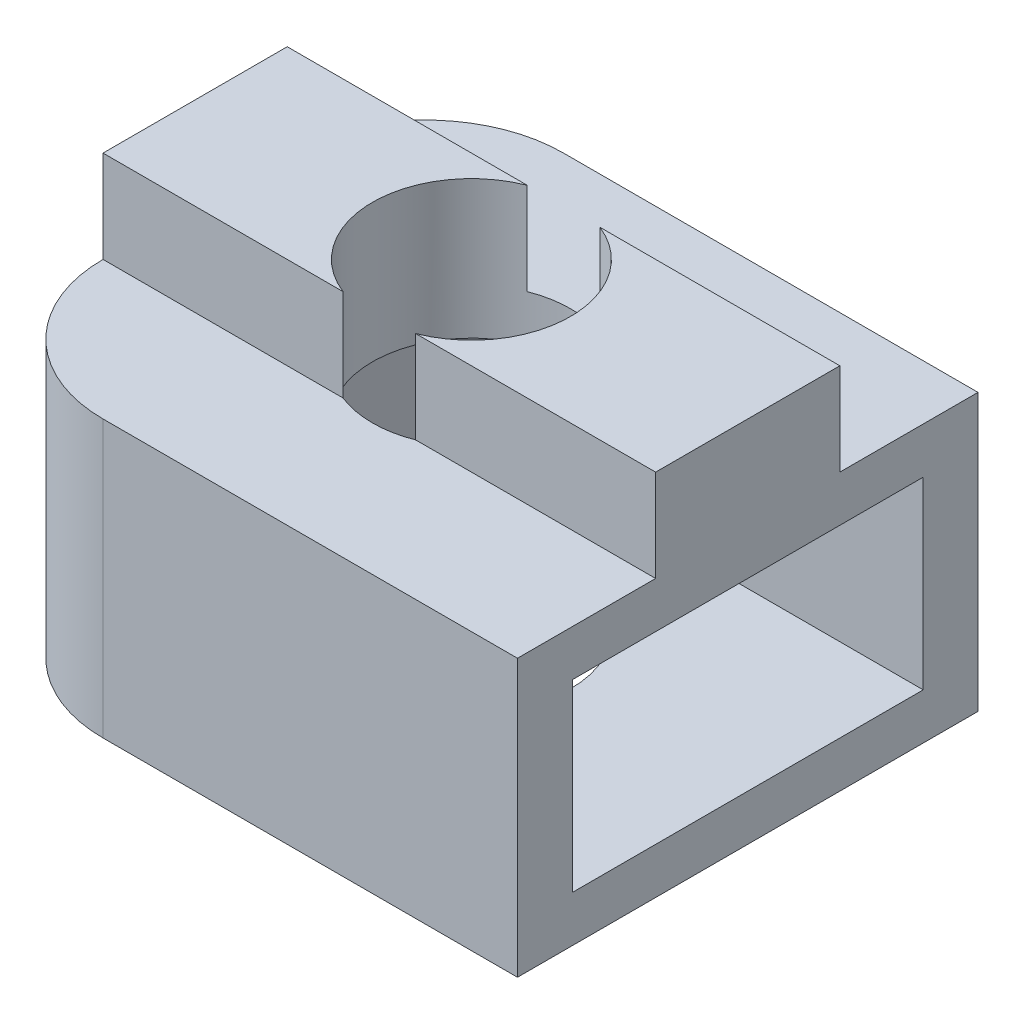
ISO-10303-21;
HEADER;
FILE_DESCRIPTION(('STEP AP214'),'2;1');
FILE_NAME('part.step','',(''),(''),'','','');
FILE_SCHEMA(('AUTOMOTIVE_DESIGN { 1 0 10303 214 1 1 1 1 }'));
ENDSEC;
DATA;
#1=APPLICATION_CONTEXT('core data for automotive mechanical design processes');
#2=APPLICATION_PROTOCOL_DEFINITION('international standard','automotive_design',2000,#1);
#3=PRODUCT_CONTEXT('',#1,'mechanical');
#4=PRODUCT('Part','Part','',(#3));
#5=PRODUCT_RELATED_PRODUCT_CATEGORY('part','',(#4));
#6=PRODUCT_DEFINITION_FORMATION('','',#4);
#7=PRODUCT_DEFINITION_CONTEXT('part definition',#1,'design');
#8=PRODUCT_DEFINITION('design','',#6,#7);
#9=PRODUCT_DEFINITION_SHAPE('','',#8);
#10=(LENGTH_UNIT() NAMED_UNIT(*) SI_UNIT(.MILLI.,.METRE.));
#11=(NAMED_UNIT(*) PLANE_ANGLE_UNIT() SI_UNIT($,.RADIAN.));
#12=(NAMED_UNIT(*) SI_UNIT($,.STERADIAN.) SOLID_ANGLE_UNIT());
#13=UNCERTAINTY_MEASURE_WITH_UNIT(LENGTH_MEASURE(1.E-05),#10,'distance_accuracy_value','');
#14=(GEOMETRIC_REPRESENTATION_CONTEXT(3) GLOBAL_UNCERTAINTY_ASSIGNED_CONTEXT((#13)) GLOBAL_UNIT_ASSIGNED_CONTEXT((#10,
#11,#12)) REPRESENTATION_CONTEXT('',''));
#15=CARTESIAN_POINT('',(0.,0.,0.));
#16=DIRECTION('',(0.,0.,1.));
#17=DIRECTION('',(1.,0.,0.));
#18=AXIS2_PLACEMENT_3D('',#15,#16,#17);
#19=CARTESIAN_POINT('',(-6.,8.,2.));
#20=DIRECTION('',(0.,0.,-1.));
#21=DIRECTION('',(-1.,0.,0.));
#22=AXIS2_PLACEMENT_3D('',#19,#20,#21);
#23=PLANE('',#22);
#24=DIRECTION('',(1.,0.,0.));
#25=VECTOR('',#24,1.);
#26=CARTESIAN_POINT('',(-6.,6.,2.));
#27=LINE('',#26,#25);
#28=CARTESIAN_POINT('',(-6.,6.,2.));
#29=VERTEX_POINT('',#28);
#30=CARTESIAN_POINT('',(-0.788986691902975,6.,2.));
#31=VERTEX_POINT('',#30);
#32=EDGE_CURVE('E205',#29,#31,#27,.T.);
#33=ORIENTED_EDGE('',*,*,#32,.T.);
#34=DIRECTION('',(0.,1.,0.));
#35=VECTOR('',#34,1.);
#36=CARTESIAN_POINT('',(-0.788986691902975,0.,2.));
#37=LINE('',#36,#35);
#38=CARTESIAN_POINT('',(-0.788986691902975,8.,2.));
#39=VERTEX_POINT('',#38);
#40=EDGE_CURVE('E343',#31,#39,#37,.T.);
#41=ORIENTED_EDGE('',*,*,#40,.T.);
#42=DIRECTION('',(1.,0.,0.));
#43=VECTOR('',#42,1.);
#44=CARTESIAN_POINT('',(-6.,8.,2.));
#45=LINE('',#44,#43);
#46=CARTESIAN_POINT('',(-6.,8.,2.));
#47=VERTEX_POINT('',#46);
#48=EDGE_CURVE('E190',#47,#39,#45,.T.);
#49=ORIENTED_EDGE('',*,*,#48,.F.);
#50=DIRECTION('',(0.,-1.,0.));
#51=VECTOR('',#50,1.);
#52=CARTESIAN_POINT('',(-6.,8.,2.));
#53=LINE('',#52,#51);
#54=EDGE_CURVE('E218',#47,#29,#53,.T.);
#55=ORIENTED_EDGE('',*,*,#54,.T.);
#56=EDGE_LOOP('',(#33,#41,#49,#55));
#57=FACE_BOUND('',#56,.T.);
#58=ADVANCED_FACE('F39',(#57),#23,.F.);
#59=CARTESIAN_POINT('',(-6.,8.,-2.));
#60=DIRECTION('',(0.,0.,-1.));
#61=DIRECTION('',(-1.,0.,0.));
#62=AXIS2_PLACEMENT_3D('',#59,#60,#61);
#63=PLANE('',#62);
#64=DIRECTION('',(0.,1.,0.));
#65=VECTOR('',#64,1.);
#66=CARTESIAN_POINT('',(-0.788986691902975,0.,-2.));
#67=LINE('',#66,#65);
#68=CARTESIAN_POINT('',(-0.788986691902975,6.,-2.));
#69=VERTEX_POINT('',#68);
#70=CARTESIAN_POINT('',(-0.788986691902975,8.,-2.));
#71=VERTEX_POINT('',#70);
#72=EDGE_CURVE('E175',#69,#71,#67,.T.);
#73=ORIENTED_EDGE('',*,*,#72,.F.);
#74=DIRECTION('',(1.,0.,0.));
#75=VECTOR('',#74,1.);
#76=CARTESIAN_POINT('',(-6.,6.,-2.));
#77=LINE('',#76,#75);
#78=CARTESIAN_POINT('',(-6.,6.,-2.));
#79=VERTEX_POINT('',#78);
#80=EDGE_CURVE('E196',#79,#69,#77,.T.);
#81=ORIENTED_EDGE('',*,*,#80,.F.);
#82=DIRECTION('',(0.,-1.,0.));
#83=VECTOR('',#82,1.);
#84=CARTESIAN_POINT('',(-6.,8.,-2.));
#85=LINE('',#84,#83);
#86=CARTESIAN_POINT('',(-6.,8.,-2.));
#87=VERTEX_POINT('',#86);
#88=EDGE_CURVE('E204',#87,#79,#85,.T.);
#89=ORIENTED_EDGE('',*,*,#88,.F.);
#90=DIRECTION('',(1.,0.,0.));
#91=VECTOR('',#90,1.);
#92=CARTESIAN_POINT('',(-6.,8.,-2.));
#93=LINE('',#92,#91);
#94=EDGE_CURVE('E201',#87,#71,#93,.T.);
#95=ORIENTED_EDGE('',*,*,#94,.T.);
#96=EDGE_LOOP('',(#73,#81,#89,#95));
#97=FACE_BOUND('',#96,.T.);
#98=ADVANCED_FACE('F334',(#97),#63,.T.);
#99=CARTESIAN_POINT('',(0.,8.,0.));
#100=DIRECTION('',(0.,1.,0.));
#101=DIRECTION('',(0.,0.,1.));
#102=AXIS2_PLACEMENT_3D('',#99,#100,#101);
#103=PLANE('',#102);
#104=CARTESIAN_POINT('',(0.,8.,0.));
#105=DIRECTION('',(0.,1.,0.));
#106=DIRECTION('',(0.,0.,1.));
#107=AXIS2_PLACEMENT_3D('',#104,#105,#106);
#108=CIRCLE('',#107,2.15);
#109=CARTESIAN_POINT('',(0.788986691902975,8.,2.));
#110=VERTEX_POINT('',#109);
#111=CARTESIAN_POINT('',(0.788986691902975,8.,-2.));
#112=VERTEX_POINT('',#111);
#113=EDGE_CURVE('E168',#110,#112,#108,.T.);
#114=ORIENTED_EDGE('',*,*,#113,.F.);
#115=CARTESIAN_POINT('',(6.,8.,2.));
#116=VERTEX_POINT('',#115);
#117=EDGE_CURVE('E181',#110,#116,#45,.T.);
#118=ORIENTED_EDGE('',*,*,#117,.T.);
#119=DIRECTION('',(0.,0.,1.));
#120=VECTOR('',#119,1.);
#121=CARTESIAN_POINT('',(6.,8.,-2.));
#122=LINE('',#121,#120);
#123=CARTESIAN_POINT('',(6.,8.,-2.));
#124=VERTEX_POINT('',#123);
#125=EDGE_CURVE('E194',#124,#116,#122,.T.);
#126=ORIENTED_EDGE('',*,*,#125,.F.);
#127=EDGE_CURVE('E183',#112,#124,#93,.T.);
#128=ORIENTED_EDGE('',*,*,#127,.F.);
#129=EDGE_LOOP('',(#114,#118,#126,#128));
#130=FACE_BOUND('',#129,.T.);
#131=ADVANCED_FACE('F179',(#130),#103,.T.);
#132=CARTESIAN_POINT('',(0.,6.,0.));
#133=DIRECTION('',(0.,1.,0.));
#134=DIRECTION('',(0.,0.,1.));
#135=AXIS2_PLACEMENT_3D('',#132,#133,#134);
#136=PLANE('',#135);
#137=DIRECTION('',(-1.,0.,0.));
#138=VECTOR('',#137,1.);
#139=CARTESIAN_POINT('',(-6.,6.,-5.));
#140=LINE('',#139,#138);
#141=CARTESIAN_POINT('',(6.,6.,-5.));
#142=VERTEX_POINT('',#141);
#143=CARTESIAN_POINT('',(-3.,6.,-5.));
#144=VERTEX_POINT('',#143);
#145=EDGE_CURVE('E228',#142,#144,#140,.T.);
#146=ORIENTED_EDGE('',*,*,#145,.T.);
#147=CARTESIAN_POINT('',(-3.,6.,-2.));
#148=DIRECTION('',(0.,1.,0.));
#149=DIRECTION('',(0.,0.,1.));
#150=AXIS2_PLACEMENT_3D('',#147,#148,#149);
#151=CIRCLE('',#150,3.);
#152=EDGE_CURVE('E11',#144,#79,#151,.T.);
#153=ORIENTED_EDGE('',*,*,#152,.T.);
#154=ORIENTED_EDGE('',*,*,#80,.T.);
#155=CARTESIAN_POINT('',(0.,6.,0.));
#156=DIRECTION('',(0.,1.,0.));
#157=DIRECTION('',(0.,0.,1.));
#158=AXIS2_PLACEMENT_3D('',#155,#156,#157);
#159=CIRCLE('',#158,2.15);
#160=CARTESIAN_POINT('',(0.788986691902975,6.,-2.));
#161=VERTEX_POINT('',#160);
#162=EDGE_CURVE('E336',#161,#69,#159,.T.);
#163=ORIENTED_EDGE('',*,*,#162,.F.);
#164=CARTESIAN_POINT('',(6.,6.,-2.));
#165=VERTEX_POINT('',#164);
#166=EDGE_CURVE('E208',#161,#165,#77,.T.);
#167=ORIENTED_EDGE('',*,*,#166,.T.);
#168=DIRECTION('',(0.,0.,-1.));
#169=VECTOR('',#168,1.);
#170=CARTESIAN_POINT('',(6.,6.,-5.));
#171=LINE('',#170,#169);
#172=EDGE_CURVE('E224',#165,#142,#171,.T.);
#173=ORIENTED_EDGE('',*,*,#172,.T.);
#174=EDGE_LOOP('',(#146,#153,#154,#163,#167,#173));
#175=FACE_BOUND('',#174,.T.);
#176=ADVANCED_FACE('F328',(#175),#136,.T.);
#177=CARTESIAN_POINT('',(0.,1.,0.));
#178=DIRECTION('',(0.,-1.,0.));
#179=DIRECTION('',(0.,0.,-1.));
#180=AXIS2_PLACEMENT_3D('',#177,#178,#179);
#181=PLANE('',#180);
#182=CARTESIAN_POINT('',(0.,1.,0.));
#183=DIRECTION('',(0.,-1.,0.));
#184=DIRECTION('',(0.,0.,-1.));
#185=AXIS2_PLACEMENT_3D('',#182,#183,#184);
#186=CIRCLE('',#185,2.15);
#187=CARTESIAN_POINT('',(0.,1.,-2.15));
#188=VERTEX_POINT('',#187);
#189=EDGE_CURVE('E348',#188,#188,#186,.T.);
#190=ORIENTED_EDGE('',*,*,#189,.T.);
#191=EDGE_LOOP('',(#190));
#192=FACE_BOUND('',#191,.T.);
#193=DIRECTION('',(1.,0.,0.));
#194=VECTOR('',#193,1.);
#195=CARTESIAN_POINT('',(2.2,1.,-3.81051177665153));
#196=LINE('',#195,#194);
#197=CARTESIAN_POINT('',(-2.2,1.,-3.81051177665153));
#198=VERTEX_POINT('',#197);
#199=CARTESIAN_POINT('',(6.,1.,-3.81051177665153));
#200=VERTEX_POINT('',#199);
#201=EDGE_CURVE('E237',#198,#200,#196,.T.);
#202=ORIENTED_EDGE('',*,*,#201,.F.);
#203=DIRECTION('',(0.5,0.,-0.866025403784439));
#204=VECTOR('',#203,1.);
#205=CARTESIAN_POINT('',(-2.2,1.,-3.81051177665153));
#206=LINE('',#205,#204);
#207=CARTESIAN_POINT('',(-4.4,1.,0.));
#208=VERTEX_POINT('',#207);
#209=EDGE_CURVE('E252',#208,#198,#206,.T.);
#210=ORIENTED_EDGE('',*,*,#209,.F.);
#211=DIRECTION('',(-0.5,0.,-0.866025403784439));
#212=VECTOR('',#211,1.);
#213=CARTESIAN_POINT('',(-4.4,1.,0.));
#214=LINE('',#213,#212);
#215=CARTESIAN_POINT('',(-2.2,1.,3.81051177665153));
#216=VERTEX_POINT('',#215);
#217=EDGE_CURVE('E249',#216,#208,#214,.T.);
#218=ORIENTED_EDGE('',*,*,#217,.F.);
#219=DIRECTION('',(-1.,0.,0.));
#220=VECTOR('',#219,1.);
#221=CARTESIAN_POINT('',(-2.2,1.,3.81051177665153));
#222=LINE('',#221,#220);
#223=CARTESIAN_POINT('',(6.,1.,3.81051177665153));
#224=VERTEX_POINT('',#223);
#225=EDGE_CURVE('E230',#224,#216,#222,.T.);
#226=ORIENTED_EDGE('',*,*,#225,.F.);
#227=DIRECTION('',(0.,0.,1.));
#228=VECTOR('',#227,1.);
#229=CARTESIAN_POINT('',(6.,1.,-5.));
#230=LINE('',#229,#228);
#231=EDGE_CURVE('E272',#200,#224,#230,.T.);
#232=ORIENTED_EDGE('',*,*,#231,.F.);
#233=EDGE_LOOP('',(#202,#210,#218,#226,#232));
#234=FACE_BOUND('',#233,.T.);
#235=ADVANCED_FACE('F398',(#192,#234),#181,.F.);
#236=CARTESIAN_POINT('',(-6.,1.,-5.));
#237=DIRECTION('',(0.,0.,-1.));
#238=DIRECTION('',(-1.,0.,0.));
#239=AXIS2_PLACEMENT_3D('',#236,#237,#238);
#240=PLANE('',#239);
#241=DIRECTION('',(1.,0.,0.));
#242=VECTOR('',#241,1.);
#243=CARTESIAN_POINT('',(-6.,0.,-5.));
#244=LINE('',#243,#242);
#245=CARTESIAN_POINT('',(-3.,0.,-5.));
#246=VERTEX_POINT('',#245);
#247=CARTESIAN_POINT('',(6.,0.,-5.));
#248=VERTEX_POINT('',#247);
#249=EDGE_CURVE('E271',#246,#248,#244,.T.);
#250=ORIENTED_EDGE('',*,*,#249,.F.);
#251=DIRECTION('',(0.,-1.,0.));
#252=VECTOR('',#251,1.);
#253=CARTESIAN_POINT('',(-3.,6.,-5.));
#254=LINE('',#253,#252);
#255=EDGE_CURVE('E47',#246,#144,#254,.F.);
#256=ORIENTED_EDGE('',*,*,#255,.T.);
#257=ORIENTED_EDGE('',*,*,#145,.F.);
#258=DIRECTION('',(0.,-1.,0.));
#259=VECTOR('',#258,1.);
#260=CARTESIAN_POINT('',(6.,1.,-5.));
#261=LINE('',#260,#259);
#262=EDGE_CURVE('E275',#142,#248,#261,.T.);
#263=ORIENTED_EDGE('',*,*,#262,.T.);
#264=EDGE_LOOP('',(#250,#256,#257,#263));
#265=FACE_BOUND('',#264,.T.);
#266=ADVANCED_FACE('F323',(#265),#240,.T.);
#267=CARTESIAN_POINT('',(-6.,1.,-5.));
#268=DIRECTION('',(1.,0.,0.));
#269=DIRECTION('',(0.,0.,-1.));
#270=AXIS2_PLACEMENT_3D('',#267,#268,#269);
#271=PLANE('',#270);
#272=DIRECTION('',(0.,0.,1.));
#273=VECTOR('',#272,1.);
#274=CARTESIAN_POINT('',(-6.,0.,-5.));
#275=LINE('',#274,#273);
#276=CARTESIAN_POINT('',(-6.,0.,-2.));
#277=VERTEX_POINT('',#276);
#278=CARTESIAN_POINT('',(-6.,0.,2.));
#279=VERTEX_POINT('',#278);
#280=EDGE_CURVE('E276',#277,#279,#275,.T.);
#281=ORIENTED_EDGE('',*,*,#280,.T.);
#282=DIRECTION('',(0.,-1.,0.));
#283=VECTOR('',#282,1.);
#284=CARTESIAN_POINT('',(-6.,1.,2.));
#285=LINE('',#284,#283);
#286=EDGE_CURVE('E300',#279,#29,#285,.F.);
#287=ORIENTED_EDGE('',*,*,#286,.T.);
#288=ORIENTED_EDGE('',*,*,#54,.F.);
#289=DIRECTION('',(0.,0.,1.));
#290=VECTOR('',#289,1.);
#291=CARTESIAN_POINT('',(-6.,8.,-2.));
#292=LINE('',#291,#290);
#293=EDGE_CURVE('E191',#87,#47,#292,.T.);
#294=ORIENTED_EDGE('',*,*,#293,.F.);
#295=ORIENTED_EDGE('',*,*,#88,.T.);
#296=DIRECTION('',(0.,-1.,0.));
#297=VECTOR('',#296,1.);
#298=CARTESIAN_POINT('',(-6.,0.,-2.));
#299=LINE('',#298,#297);
#300=EDGE_CURVE('E297',#79,#277,#299,.T.);
#301=ORIENTED_EDGE('',*,*,#300,.T.);
#302=EDGE_LOOP('',(#281,#287,#288,#294,#295,#301));
#303=FACE_BOUND('',#302,.T.);
#304=ADVANCED_FACE('F318',(#303),#271,.F.);
#305=CARTESIAN_POINT('',(-6.,1.,5.));
#306=DIRECTION('',(0.,0.,-1.));
#307=DIRECTION('',(-1.,0.,0.));
#308=AXIS2_PLACEMENT_3D('',#305,#306,#307);
#309=PLANE('',#308);
#310=DIRECTION('',(1.,0.,0.));
#311=VECTOR('',#310,1.);
#312=CARTESIAN_POINT('',(-6.,6.,5.));
#313=LINE('',#312,#311);
#314=CARTESIAN_POINT('',(-3.,6.,5.));
#315=VERTEX_POINT('',#314);
#316=CARTESIAN_POINT('',(6.,6.,5.));
#317=VERTEX_POINT('',#316);
#318=EDGE_CURVE('E222',#315,#317,#313,.T.);
#319=ORIENTED_EDGE('',*,*,#318,.F.);
#320=DIRECTION('',(0.,-1.,0.));
#321=VECTOR('',#320,1.);
#322=CARTESIAN_POINT('',(-3.,1.,5.));
#323=LINE('',#322,#321);
#324=CARTESIAN_POINT('',(-3.,0.,5.));
#325=VERTEX_POINT('',#324);
#326=EDGE_CURVE('E291',#315,#325,#323,.T.);
#327=ORIENTED_EDGE('',*,*,#326,.T.);
#328=DIRECTION('',(1.,0.,0.));
#329=VECTOR('',#328,1.);
#330=CARTESIAN_POINT('',(-6.,0.,5.));
#331=LINE('',#330,#329);
#332=CARTESIAN_POINT('',(6.,0.,5.));
#333=VERTEX_POINT('',#332);
#334=EDGE_CURVE('E281',#325,#333,#331,.T.);
#335=ORIENTED_EDGE('',*,*,#334,.T.);
#336=DIRECTION('',(0.,-1.,0.));
#337=VECTOR('',#336,1.);
#338=CARTESIAN_POINT('',(6.,1.,5.));
#339=LINE('',#338,#337);
#340=EDGE_CURVE('E284',#317,#333,#339,.T.);
#341=ORIENTED_EDGE('',*,*,#340,.F.);
#342=EDGE_LOOP('',(#319,#327,#335,#341));
#343=FACE_BOUND('',#342,.T.);
#344=ADVANCED_FACE('F313',(#343),#309,.F.);
#345=CARTESIAN_POINT('',(6.,1.,-5.));
#346=DIRECTION('',(1.,0.,0.));
#347=DIRECTION('',(0.,0.,-1.));
#348=AXIS2_PLACEMENT_3D('',#345,#346,#347);
#349=PLANE('',#348);
#350=DIRECTION('',(0.,-1.,0.));
#351=VECTOR('',#350,1.);
#352=CARTESIAN_POINT('',(6.,5.,3.81051177665153));
#353=LINE('',#352,#351);
#354=CARTESIAN_POINT('',(6.,5.,3.81051177665153));
#355=VERTEX_POINT('',#354);
#356=EDGE_CURVE('E268',#355,#224,#353,.T.);
#357=ORIENTED_EDGE('',*,*,#356,.F.);
#358=DIRECTION('',(0.,0.,-1.));
#359=VECTOR('',#358,1.);
#360=CARTESIAN_POINT('',(6.,5.,-5.));
#361=LINE('',#360,#359);
#362=CARTESIAN_POINT('',(6.,5.,-3.81051177665153));
#363=VERTEX_POINT('',#362);
#364=EDGE_CURVE('E221',#355,#363,#361,.T.);
#365=ORIENTED_EDGE('',*,*,#364,.T.);
#366=DIRECTION('',(0.,-1.,0.));
#367=VECTOR('',#366,1.);
#368=CARTESIAN_POINT('',(6.,5.,-3.81051177665153));
#369=LINE('',#368,#367);
#370=EDGE_CURVE('E246',#363,#200,#369,.T.);
#371=ORIENTED_EDGE('',*,*,#370,.T.);
#372=ORIENTED_EDGE('',*,*,#231,.T.);
#373=EDGE_LOOP('',(#357,#365,#371,#372));
#374=FACE_BOUND('',#373,.T.);
#375=DIRECTION('',(0.,0.,1.));
#376=VECTOR('',#375,1.);
#377=CARTESIAN_POINT('',(6.,0.,-5.));
#378=LINE('',#377,#376);
#379=EDGE_CURVE('E278',#248,#333,#378,.T.);
#380=ORIENTED_EDGE('',*,*,#379,.F.);
#381=ORIENTED_EDGE('',*,*,#262,.F.);
#382=ORIENTED_EDGE('',*,*,#172,.F.);
#383=DIRECTION('',(0.,-1.,0.));
#384=VECTOR('',#383,1.);
#385=CARTESIAN_POINT('',(6.,8.,-2.));
#386=LINE('',#385,#384);
#387=EDGE_CURVE('E214',#124,#165,#386,.T.);
#388=ORIENTED_EDGE('',*,*,#387,.F.);
#389=ORIENTED_EDGE('',*,*,#125,.T.);
#390=DIRECTION('',(0.,-1.,0.));
#391=VECTOR('',#390,1.);
#392=CARTESIAN_POINT('',(6.,8.,2.));
#393=LINE('',#392,#391);
#394=CARTESIAN_POINT('',(6.,6.,2.));
#395=VERTEX_POINT('',#394);
#396=EDGE_CURVE('E188',#116,#395,#393,.T.);
#397=ORIENTED_EDGE('',*,*,#396,.T.);
#398=EDGE_CURVE('E225',#317,#395,#171,.T.);
#399=ORIENTED_EDGE('',*,*,#398,.F.);
#400=ORIENTED_EDGE('',*,*,#340,.T.);
#401=EDGE_LOOP('',(#380,#381,#382,#388,#389,#397,#399,#400));
#402=FACE_BOUND('',#401,.T.);
#403=ADVANCED_FACE('F353',(#374,#402),#349,.T.);
#404=CARTESIAN_POINT('',(0.,0.,0.));
#405=DIRECTION('',(0.,-1.,0.));
#406=DIRECTION('',(0.,0.,-1.));
#407=AXIS2_PLACEMENT_3D('',#404,#405,#406);
#408=PLANE('',#407);
#409=CARTESIAN_POINT('',(0.,0.,0.));
#410=DIRECTION('',(0.,1.,0.));
#411=DIRECTION('',(0.,0.,1.));
#412=AXIS2_PLACEMENT_3D('',#409,#410,#411);
#413=CIRCLE('',#412,2.15);
#414=CARTESIAN_POINT('',(0.,0.,2.15));
#415=VERTEX_POINT('',#414);
#416=EDGE_CURVE('E184',#415,#415,#413,.T.);
#417=ORIENTED_EDGE('',*,*,#416,.T.);
#418=EDGE_LOOP('',(#417));
#419=FACE_BOUND('',#418,.T.);
#420=ORIENTED_EDGE('',*,*,#334,.F.);
#421=CARTESIAN_POINT('',(-3.,0.,2.));
#422=DIRECTION('',(0.,-1.,0.));
#423=DIRECTION('',(0.,0.,-1.));
#424=AXIS2_PLACEMENT_3D('',#421,#422,#423);
#425=CIRCLE('',#424,3.);
#426=EDGE_CURVE('E61',#325,#279,#425,.T.);
#427=ORIENTED_EDGE('',*,*,#426,.T.);
#428=ORIENTED_EDGE('',*,*,#280,.F.);
#429=CARTESIAN_POINT('',(-3.,0.,-2.));
#430=DIRECTION('',(0.,-1.,0.));
#431=DIRECTION('',(0.,0.,-1.));
#432=AXIS2_PLACEMENT_3D('',#429,#430,#431);
#433=CIRCLE('',#432,3.);
#434=EDGE_CURVE('E294',#277,#246,#433,.T.);
#435=ORIENTED_EDGE('',*,*,#434,.T.);
#436=ORIENTED_EDGE('',*,*,#249,.T.);
#437=ORIENTED_EDGE('',*,*,#379,.T.);
#438=EDGE_LOOP('',(#420,#427,#428,#435,#436,#437));
#439=FACE_BOUND('',#438,.T.);
#440=ADVANCED_FACE('F321',(#419,#439),#408,.T.);
#441=CARTESIAN_POINT('',(-2.2,5.,3.81051177665153));
#442=DIRECTION('',(0.,0.,1.));
#443=DIRECTION('',(1.,0.,0.));
#444=AXIS2_PLACEMENT_3D('',#441,#442,#443);
#445=PLANE('',#444);
#446=ORIENTED_EDGE('',*,*,#225,.T.);
#447=DIRECTION('',(0.,-1.,0.));
#448=VECTOR('',#447,1.);
#449=CARTESIAN_POINT('',(-2.2,5.,3.81051177665153));
#450=LINE('',#449,#448);
#451=CARTESIAN_POINT('',(-2.2,5.,3.81051177665153));
#452=VERTEX_POINT('',#451);
#453=EDGE_CURVE('E265',#452,#216,#450,.T.);
#454=ORIENTED_EDGE('',*,*,#453,.F.);
#455=DIRECTION('',(-1.,0.,0.));
#456=VECTOR('',#455,1.);
#457=CARTESIAN_POINT('',(2.2,5.,3.81051177665153));
#458=LINE('',#457,#456);
#459=EDGE_CURVE('E233',#355,#452,#458,.T.);
#460=ORIENTED_EDGE('',*,*,#459,.F.);
#461=ORIENTED_EDGE('',*,*,#356,.T.);
#462=EDGE_LOOP('',(#446,#454,#460,#461));
#463=FACE_BOUND('',#462,.T.);
#464=ADVANCED_FACE('F586',(#463),#445,.F.);
#465=CARTESIAN_POINT('',(-4.4,5.,0.));
#466=DIRECTION('',(-0.866025403784439,0.,0.5));
#467=DIRECTION('',(0.5,0.,0.866025403784439));
#468=AXIS2_PLACEMENT_3D('',#465,#466,#467);
#469=PLANE('',#468);
#470=ORIENTED_EDGE('',*,*,#217,.T.);
#471=DIRECTION('',(0.,-1.,0.));
#472=VECTOR('',#471,1.);
#473=CARTESIAN_POINT('',(-4.4,5.,0.));
#474=LINE('',#473,#472);
#475=CARTESIAN_POINT('',(-4.4,5.,0.));
#476=VERTEX_POINT('',#475);
#477=EDGE_CURVE('E262',#476,#208,#474,.T.);
#478=ORIENTED_EDGE('',*,*,#477,.F.);
#479=DIRECTION('',(-0.5,0.,-0.866025403784439));
#480=VECTOR('',#479,1.);
#481=CARTESIAN_POINT('',(-4.4,5.,0.));
#482=LINE('',#481,#480);
#483=EDGE_CURVE('E236',#452,#476,#482,.T.);
#484=ORIENTED_EDGE('',*,*,#483,.F.);
#485=ORIENTED_EDGE('',*,*,#453,.T.);
#486=EDGE_LOOP('',(#470,#478,#484,#485));
#487=FACE_BOUND('',#486,.T.);
#488=ADVANCED_FACE('F594',(#487),#469,.F.);
#489=CARTESIAN_POINT('',(-2.2,5.,-3.81051177665153));
#490=DIRECTION('',(-0.866025403784439,0.,-0.5));
#491=DIRECTION('',(-0.5,0.,0.866025403784439));
#492=AXIS2_PLACEMENT_3D('',#489,#490,#491);
#493=PLANE('',#492);
#494=ORIENTED_EDGE('',*,*,#209,.T.);
#495=DIRECTION('',(0.,-1.,0.));
#496=VECTOR('',#495,1.);
#497=CARTESIAN_POINT('',(-2.2,5.,-3.81051177665153));
#498=LINE('',#497,#496);
#499=CARTESIAN_POINT('',(-2.2,5.,-3.81051177665153));
#500=VERTEX_POINT('',#499);
#501=EDGE_CURVE('E259',#500,#198,#498,.T.);
#502=ORIENTED_EDGE('',*,*,#501,.F.);
#503=DIRECTION('',(0.5,0.,-0.866025403784439));
#504=VECTOR('',#503,1.);
#505=CARTESIAN_POINT('',(-2.2,5.,-3.81051177665153));
#506=LINE('',#505,#504);
#507=EDGE_CURVE('E240',#476,#500,#506,.T.);
#508=ORIENTED_EDGE('',*,*,#507,.F.);
#509=ORIENTED_EDGE('',*,*,#477,.T.);
#510=EDGE_LOOP('',(#494,#502,#508,#509));
#511=FACE_BOUND('',#510,.T.);
#512=ADVANCED_FACE('F602',(#511),#493,.F.);
#513=CARTESIAN_POINT('',(2.2,5.,-3.81051177665153));
#514=DIRECTION('',(0.,0.,-1.));
#515=DIRECTION('',(-1.,0.,0.));
#516=AXIS2_PLACEMENT_3D('',#513,#514,#515);
#517=PLANE('',#516);
#518=ORIENTED_EDGE('',*,*,#201,.T.);
#519=ORIENTED_EDGE('',*,*,#370,.F.);
#520=DIRECTION('',(1.,0.,0.));
#521=VECTOR('',#520,1.);
#522=CARTESIAN_POINT('',(2.2,5.,-3.81051177665153));
#523=LINE('',#522,#521);
#524=EDGE_CURVE('E243',#500,#363,#523,.T.);
#525=ORIENTED_EDGE('',*,*,#524,.F.);
#526=ORIENTED_EDGE('',*,*,#501,.T.);
#527=EDGE_LOOP('',(#518,#519,#525,#526));
#528=FACE_BOUND('',#527,.T.);
#529=ADVANCED_FACE('F394',(#528),#517,.F.);
#530=CARTESIAN_POINT('',(0.,5.,0.));
#531=DIRECTION('',(0.,1.,0.));
#532=DIRECTION('',(0.,0.,1.));
#533=AXIS2_PLACEMENT_3D('',#530,#531,#532);
#534=PLANE('',#533);
#535=CARTESIAN_POINT('',(0.,5.,0.));
#536=DIRECTION('',(0.,1.,0.));
#537=DIRECTION('',(0.,0.,1.));
#538=AXIS2_PLACEMENT_3D('',#535,#536,#537);
#539=CIRCLE('',#538,2.15);
#540=CARTESIAN_POINT('',(0.,5.,2.15));
#541=VERTEX_POINT('',#540);
#542=EDGE_CURVE('E346',#541,#541,#539,.T.);
#543=ORIENTED_EDGE('',*,*,#542,.T.);
#544=EDGE_LOOP('',(#543));
#545=FACE_BOUND('',#544,.T.);
#546=ORIENTED_EDGE('',*,*,#364,.F.);
#547=ORIENTED_EDGE('',*,*,#459,.T.);
#548=ORIENTED_EDGE('',*,*,#483,.T.);
#549=ORIENTED_EDGE('',*,*,#507,.T.);
#550=ORIENTED_EDGE('',*,*,#524,.T.);
#551=EDGE_LOOP('',(#546,#547,#548,#549,#550));
#552=FACE_BOUND('',#551,.T.);
#553=ADVANCED_FACE('F389',(#545,#552),#534,.F.);
#554=ORIENTED_EDGE('',*,*,#32,.F.);
#555=CARTESIAN_POINT('',(-3.,6.,2.));
#556=DIRECTION('',(0.,1.,0.));
#557=DIRECTION('',(0.,0.,1.));
#558=AXIS2_PLACEMENT_3D('',#555,#556,#557);
#559=CIRCLE('',#558,3.);
#560=EDGE_CURVE('E302',#29,#315,#559,.T.);
#561=ORIENTED_EDGE('',*,*,#560,.T.);
#562=ORIENTED_EDGE('',*,*,#318,.T.);
#563=ORIENTED_EDGE('',*,*,#398,.T.);
#564=CARTESIAN_POINT('',(0.788986691902975,6.,2.));
#565=VERTEX_POINT('',#564);
#566=EDGE_CURVE('E209',#565,#395,#27,.T.);
#567=ORIENTED_EDGE('',*,*,#566,.F.);
#568=CARTESIAN_POINT('',(0.,6.,0.));
#569=DIRECTION('',(0.,1.,0.));
#570=DIRECTION('',(0.,0.,1.));
#571=AXIS2_PLACEMENT_3D('',#568,#569,#570);
#572=CIRCLE('',#571,2.15);
#573=EDGE_CURVE('E171',#31,#565,#572,.T.);
#574=ORIENTED_EDGE('',*,*,#573,.F.);
#575=EDGE_LOOP('',(#554,#561,#562,#563,#567,#574));
#576=FACE_BOUND('',#575,.T.);
#577=ADVANCED_FACE('F307',(#576),#136,.T.);
#578=ORIENTED_EDGE('',*,*,#117,.F.);
#579=DIRECTION('',(0.,1.,0.));
#580=VECTOR('',#579,1.);
#581=CARTESIAN_POINT('',(0.788986691902975,0.,2.));
#582=LINE('',#581,#580);
#583=EDGE_CURVE('E164',#110,#565,#582,.F.);
#584=ORIENTED_EDGE('',*,*,#583,.T.);
#585=ORIENTED_EDGE('',*,*,#566,.T.);
#586=ORIENTED_EDGE('',*,*,#396,.F.);
#587=EDGE_LOOP('',(#578,#584,#585,#586));
#588=FACE_BOUND('',#587,.T.);
#589=ADVANCED_FACE('F186',(#588),#23,.F.);
#590=DIRECTION('',(0.,1.,0.));
#591=VECTOR('',#590,1.);
#592=CARTESIAN_POINT('',(0.788986691902975,0.,-2.));
#593=LINE('',#592,#591);
#594=EDGE_CURVE('E338',#112,#161,#593,.F.);
#595=ORIENTED_EDGE('',*,*,#594,.F.);
#596=ORIENTED_EDGE('',*,*,#127,.T.);
#597=ORIENTED_EDGE('',*,*,#387,.T.);
#598=ORIENTED_EDGE('',*,*,#166,.F.);
#599=EDGE_LOOP('',(#595,#596,#597,#598));
#600=FACE_BOUND('',#599,.T.);
#601=ADVANCED_FACE('F358',(#600),#63,.T.);
#602=CARTESIAN_POINT('',(0.,8.,0.));
#603=DIRECTION('',(0.,1.,0.));
#604=DIRECTION('',(0.,0.,1.));
#605=AXIS2_PLACEMENT_3D('',#602,#603,#604);
#606=CIRCLE('',#605,2.15);
#607=EDGE_CURVE('E287',#71,#39,#606,.T.);
#608=ORIENTED_EDGE('',*,*,#607,.F.);
#609=ORIENTED_EDGE('',*,*,#94,.F.);
#610=ORIENTED_EDGE('',*,*,#293,.T.);
#611=ORIENTED_EDGE('',*,*,#48,.T.);
#612=EDGE_LOOP('',(#608,#609,#610,#611));
#613=FACE_BOUND('',#612,.T.);
#614=ADVANCED_FACE('F372',(#613),#103,.T.);
#615=CARTESIAN_POINT('',(0.,0.,0.));
#616=DIRECTION('',(0.,1.,0.));
#617=DIRECTION('',(0.,0.,1.));
#618=AXIS2_PLACEMENT_3D('',#615,#616,#617);
#619=CYLINDRICAL_SURFACE('',#618,2.15);
#620=ORIENTED_EDGE('',*,*,#573,.T.);
#621=ORIENTED_EDGE('',*,*,#583,.F.);
#622=ORIENTED_EDGE('',*,*,#113,.T.);
#623=ORIENTED_EDGE('',*,*,#594,.T.);
#624=ORIENTED_EDGE('',*,*,#162,.T.);
#625=ORIENTED_EDGE('',*,*,#72,.T.);
#626=ORIENTED_EDGE('',*,*,#607,.T.);
#627=ORIENTED_EDGE('',*,*,#40,.F.);
#628=EDGE_LOOP('',(#620,#621,#622,#623,#624,#625,#626,#627));
#629=FACE_BOUND('',#628,.T.);
#630=ORIENTED_EDGE('',*,*,#542,.F.);
#631=EDGE_LOOP('',(#630));
#632=FACE_BOUND('',#631,.T.);
#633=ADVANCED_FACE('F166',(#629,#632),#619,.F.);
#634=ORIENTED_EDGE('',*,*,#416,.F.);
#635=EDGE_LOOP('',(#634));
#636=FACE_BOUND('',#635,.T.);
#637=ORIENTED_EDGE('',*,*,#189,.F.);
#638=EDGE_LOOP('',(#637));
#639=FACE_BOUND('',#638,.T.);
#640=ADVANCED_FACE('F364',(#636,#639),#619,.F.);
#641=CARTESIAN_POINT('',(-3.,1.,2.));
#642=DIRECTION('',(0.,-1.,0.));
#643=DIRECTION('',(0.,0.,-1.));
#644=AXIS2_PLACEMENT_3D('',#641,#642,#643);
#645=CYLINDRICAL_SURFACE('',#644,3.);
#646=ORIENTED_EDGE('',*,*,#560,.F.);
#647=ORIENTED_EDGE('',*,*,#286,.F.);
#648=ORIENTED_EDGE('',*,*,#426,.F.);
#649=ORIENTED_EDGE('',*,*,#326,.F.);
#650=EDGE_LOOP('',(#646,#647,#648,#649));
#651=FACE_BOUND('',#650,.T.);
#652=ADVANCED_FACE('F315',(#651),#645,.T.);
#653=CARTESIAN_POINT('',(-3.,1.,-2.));
#654=DIRECTION('',(0.,1.,0.));
#655=DIRECTION('',(0.,0.,1.));
#656=AXIS2_PLACEMENT_3D('',#653,#654,#655);
#657=CYLINDRICAL_SURFACE('',#656,3.);
#658=ORIENTED_EDGE('',*,*,#152,.F.);
#659=ORIENTED_EDGE('',*,*,#255,.F.);
#660=ORIENTED_EDGE('',*,*,#434,.F.);
#661=ORIENTED_EDGE('',*,*,#300,.F.);
#662=EDGE_LOOP('',(#658,#659,#660,#661));
#663=FACE_BOUND('',#662,.T.);
#664=ADVANCED_FACE('F41',(#663),#657,.T.);
#665=CLOSED_SHELL('',(#58,#98,#131,#176,#235,#266,#304,#344,#403,#440,#464,#488,#512,#529,#553,
#577,#589,#601,#614,#633,#640,#652,#664));
#666=MANIFOLD_SOLID_BREP('B2',#665);
#667=ADVANCED_BREP_SHAPE_REPRESENTATION('',(#18,#666),#14);
#668=SHAPE_DEFINITION_REPRESENTATION(#9,#667);
ENDSEC;
END-ISO-10303-21;
